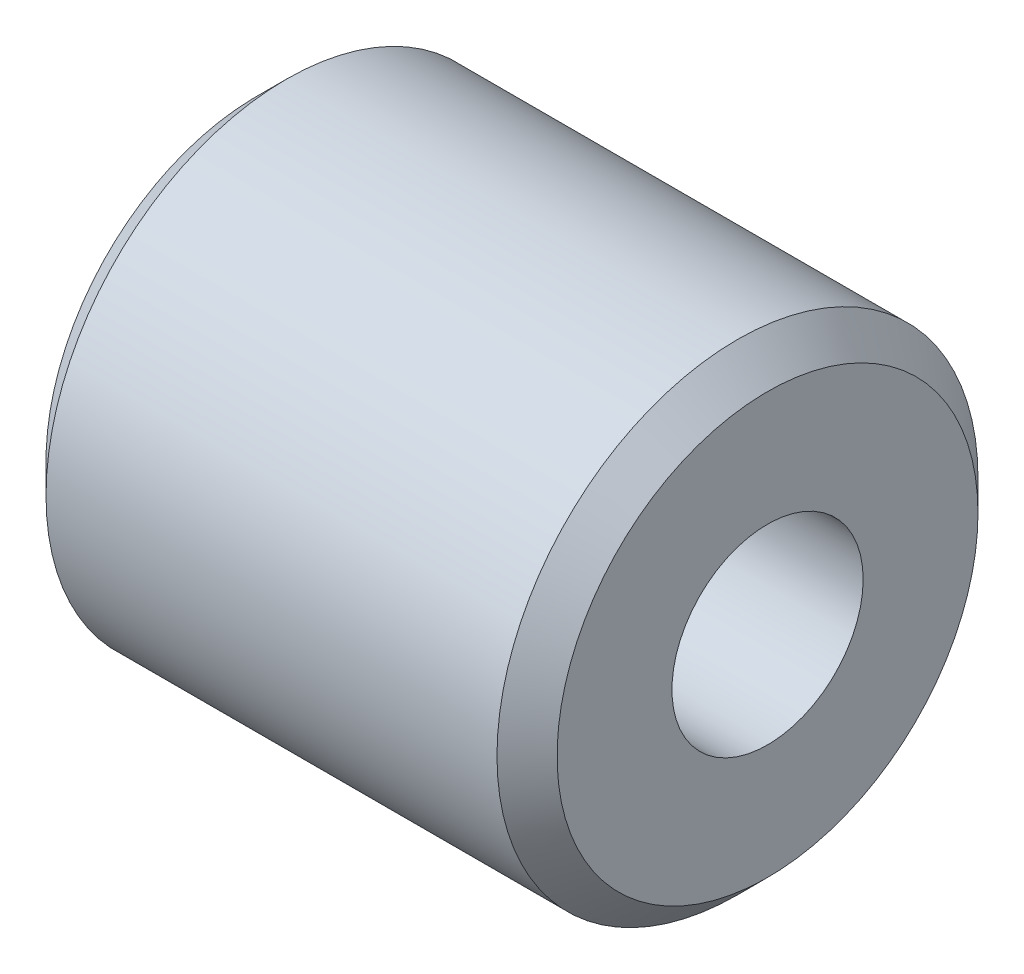
ISO-10303-21;
HEADER;
FILE_DESCRIPTION(('STEP AP214'),'2;1');
FILE_NAME('part.step','',(''),(''),'','','');
FILE_SCHEMA(('AUTOMOTIVE_DESIGN { 1 0 10303 214 1 1 1 1 }'));
ENDSEC;
DATA;
#1=APPLICATION_CONTEXT('core data for automotive mechanical design processes');
#2=APPLICATION_PROTOCOL_DEFINITION('international standard','automotive_design',2000,#1);
#3=PRODUCT_CONTEXT('',#1,'mechanical');
#4=PRODUCT('Part','Part','',(#3));
#5=PRODUCT_RELATED_PRODUCT_CATEGORY('part','',(#4));
#6=PRODUCT_DEFINITION_FORMATION('','',#4);
#7=PRODUCT_DEFINITION_CONTEXT('part definition',#1,'design');
#8=PRODUCT_DEFINITION('design','',#6,#7);
#9=PRODUCT_DEFINITION_SHAPE('','',#8);
#10=(LENGTH_UNIT() NAMED_UNIT(*) SI_UNIT(.MILLI.,.METRE.));
#11=(NAMED_UNIT(*) PLANE_ANGLE_UNIT() SI_UNIT($,.RADIAN.));
#12=(NAMED_UNIT(*) SI_UNIT($,.STERADIAN.) SOLID_ANGLE_UNIT());
#13=UNCERTAINTY_MEASURE_WITH_UNIT(LENGTH_MEASURE(1.E-05),#10,'distance_accuracy_value','');
#14=(GEOMETRIC_REPRESENTATION_CONTEXT(3) GLOBAL_UNCERTAINTY_ASSIGNED_CONTEXT((#13)) GLOBAL_UNIT_ASSIGNED_CONTEXT((#10,
#11,#12)) REPRESENTATION_CONTEXT('',''));
#15=CARTESIAN_POINT('',(0.,0.,0.));
#16=DIRECTION('',(0.,0.,1.));
#17=DIRECTION('',(1.,0.,0.));
#18=AXIS2_PLACEMENT_3D('',#15,#16,#17);
#19=CARTESIAN_POINT('',(4.25,0.,0.));
#20=DIRECTION('',(1.,0.,0.));
#21=DIRECTION('',(0.,0.,-1.));
#22=AXIS2_PLACEMENT_3D('',#19,#20,#21);
#23=PLANE('',#22);
#24=CARTESIAN_POINT('',(4.25,0.,0.));
#25=DIRECTION('',(1.,0.,0.));
#26=DIRECTION('',(0.,0.,-1.));
#27=AXIS2_PLACEMENT_3D('',#24,#25,#26);
#28=CIRCLE('',#27,3.5);
#29=CARTESIAN_POINT('',(4.25,0.,-3.5));
#30=VERTEX_POINT('',#29);
#31=EDGE_CURVE('E10',#30,#30,#28,.T.);
#32=ORIENTED_EDGE('',*,*,#31,.T.);
#33=EDGE_LOOP('',(#32));
#34=FACE_BOUND('',#33,.T.);
#35=CARTESIAN_POINT('',(4.25,0.,0.));
#36=DIRECTION('',(1.,0.,0.));
#37=DIRECTION('',(0.,0.,-1.));
#38=AXIS2_PLACEMENT_3D('',#35,#36,#37);
#39=CIRCLE('',#38,1.59);
#40=CARTESIAN_POINT('',(4.25,0.,-1.59));
#41=VERTEX_POINT('',#40);
#42=EDGE_CURVE('E50',#41,#41,#39,.T.);
#43=ORIENTED_EDGE('',*,*,#42,.F.);
#44=EDGE_LOOP('',(#43));
#45=FACE_BOUND('',#44,.T.);
#46=ADVANCED_FACE('F30',(#34,#45),#23,.T.);
#47=CARTESIAN_POINT('',(-4.25,0.,0.));
#48=DIRECTION('',(1.,0.,0.));
#49=DIRECTION('',(0.,0.,-1.));
#50=AXIS2_PLACEMENT_3D('',#47,#48,#49);
#51=PLANE('',#50);
#52=CARTESIAN_POINT('',(-4.25,0.,0.));
#53=DIRECTION('',(1.,0.,0.));
#54=DIRECTION('',(0.,0.,-1.));
#55=AXIS2_PLACEMENT_3D('',#52,#53,#54);
#56=CIRCLE('',#55,3.5);
#57=CARTESIAN_POINT('',(-4.25,0.,-3.5));
#58=VERTEX_POINT('',#57);
#59=EDGE_CURVE('E37',#58,#58,#56,.F.);
#60=ORIENTED_EDGE('',*,*,#59,.T.);
#61=EDGE_LOOP('',(#60));
#62=FACE_BOUND('',#61,.T.);
#63=CARTESIAN_POINT('',(-4.25,0.,0.));
#64=DIRECTION('',(1.,0.,0.));
#65=DIRECTION('',(0.,0.,-1.));
#66=AXIS2_PLACEMENT_3D('',#63,#64,#65);
#67=CIRCLE('',#66,1.59);
#68=CARTESIAN_POINT('',(-4.25,0.,-1.59));
#69=VERTEX_POINT('',#68);
#70=EDGE_CURVE('E51',#69,#69,#67,.T.);
#71=ORIENTED_EDGE('',*,*,#70,.T.);
#72=EDGE_LOOP('',(#71));
#73=FACE_BOUND('',#72,.T.);
#74=ADVANCED_FACE('F61',(#62,#73),#51,.F.);
#75=CARTESIAN_POINT('',(4.25,0.,0.));
#76=DIRECTION('',(-1.,0.,0.));
#77=DIRECTION('',(0.,0.,1.));
#78=AXIS2_PLACEMENT_3D('',#75,#76,#77);
#79=CYLINDRICAL_SURFACE('',#78,4.);
#80=CARTESIAN_POINT('',(-3.75,0.,0.));
#81=DIRECTION('',(1.,0.,0.));
#82=DIRECTION('',(0.,0.,-1.));
#83=AXIS2_PLACEMENT_3D('',#80,#81,#82);
#84=CIRCLE('',#83,4.);
#85=CARTESIAN_POINT('',(-3.75,0.,-4.));
#86=VERTEX_POINT('',#85);
#87=EDGE_CURVE('E41',#86,#86,#84,.T.);
#88=ORIENTED_EDGE('',*,*,#87,.T.);
#89=EDGE_LOOP('',(#88));
#90=FACE_BOUND('',#89,.T.);
#91=CARTESIAN_POINT('',(3.75,0.,0.));
#92=DIRECTION('',(1.,0.,0.));
#93=DIRECTION('',(0.,0.,-1.));
#94=AXIS2_PLACEMENT_3D('',#91,#92,#93);
#95=CIRCLE('',#94,4.);
#96=CARTESIAN_POINT('',(3.75,0.,-4.));
#97=VERTEX_POINT('',#96);
#98=EDGE_CURVE('E45',#97,#97,#95,.F.);
#99=ORIENTED_EDGE('',*,*,#98,.T.);
#100=EDGE_LOOP('',(#99));
#101=FACE_BOUND('',#100,.T.);
#102=ADVANCED_FACE('F66',(#90,#101),#79,.T.);
#103=CARTESIAN_POINT('',(4.25,0.,0.));
#104=DIRECTION('',(-1.,0.,0.));
#105=DIRECTION('',(0.,0.,1.));
#106=AXIS2_PLACEMENT_3D('',#103,#104,#105);
#107=CYLINDRICAL_SURFACE('',#106,1.59);
#108=ORIENTED_EDGE('',*,*,#42,.T.);
#109=EDGE_LOOP('',(#108));
#110=FACE_BOUND('',#109,.T.);
#111=ORIENTED_EDGE('',*,*,#70,.F.);
#112=EDGE_LOOP('',(#111));
#113=FACE_BOUND('',#112,.T.);
#114=ADVANCED_FACE('F57',(#110,#113),#107,.F.);
#115=CARTESIAN_POINT('',(-3.75,0.,0.));
#116=DIRECTION('',(1.,0.,0.));
#117=DIRECTION('',(0.,0.,-1.));
#118=AXIS2_PLACEMENT_3D('',#115,#116,#117);
#119=CONICAL_SURFACE('',#118,4.,0.78539816339745);
#120=ORIENTED_EDGE('',*,*,#59,.F.);
#121=EDGE_LOOP('',(#120));
#122=FACE_BOUND('',#121,.T.);
#123=ORIENTED_EDGE('',*,*,#87,.F.);
#124=EDGE_LOOP('',(#123));
#125=FACE_BOUND('',#124,.T.);
#126=ADVANCED_FACE('F72',(#122,#125),#119,.T.);
#127=CARTESIAN_POINT('',(4.25,0.,0.));
#128=DIRECTION('',(-1.,0.,0.));
#129=DIRECTION('',(0.,0.,1.));
#130=AXIS2_PLACEMENT_3D('',#127,#128,#129);
#131=CONICAL_SURFACE('',#130,3.5,0.785398163397447);
#132=ORIENTED_EDGE('',*,*,#98,.F.);
#133=EDGE_LOOP('',(#132));
#134=FACE_BOUND('',#133,.T.);
#135=ORIENTED_EDGE('',*,*,#31,.F.);
#136=EDGE_LOOP('',(#135));
#137=FACE_BOUND('',#136,.T.);
#138=ADVANCED_FACE('F32',(#134,#137),#131,.T.);
#139=CLOSED_SHELL('',(#46,#74,#102,#114,#126,#138));
#140=MANIFOLD_SOLID_BREP('B2',#139);
#141=ADVANCED_BREP_SHAPE_REPRESENTATION('',(#18,#140),#14);
#142=SHAPE_DEFINITION_REPRESENTATION(#9,#141);
ENDSEC;
END-ISO-10303-21;
